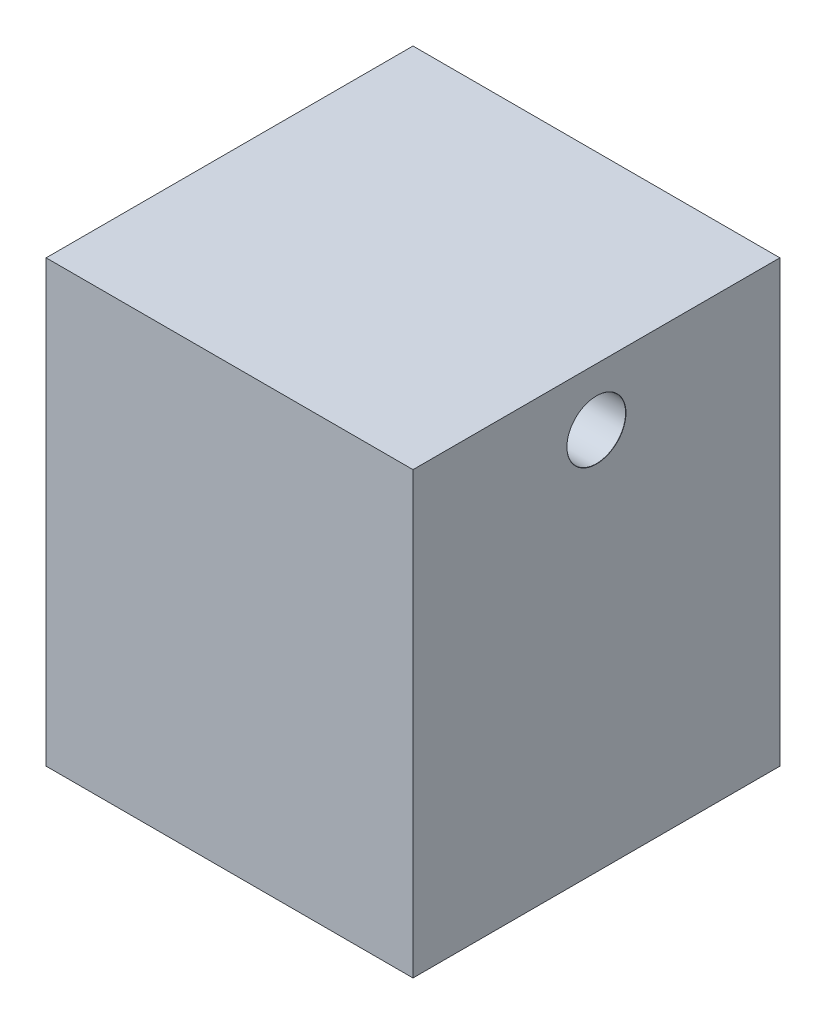
ISO-10303-21;
HEADER;
FILE_DESCRIPTION(('STEP AP214'),'2;1');
FILE_NAME('part.step','',(''),(''),'','','');
FILE_SCHEMA(('AUTOMOTIVE_DESIGN { 1 0 10303 214 1 1 1 1 }'));
ENDSEC;
DATA;
#1=APPLICATION_CONTEXT('core data for automotive mechanical design processes');
#2=APPLICATION_PROTOCOL_DEFINITION('international standard','automotive_design',2000,#1);
#3=PRODUCT_CONTEXT('',#1,'mechanical');
#4=PRODUCT('Part','Part','',(#3));
#5=PRODUCT_RELATED_PRODUCT_CATEGORY('part','',(#4));
#6=PRODUCT_DEFINITION_FORMATION('','',#4);
#7=PRODUCT_DEFINITION_CONTEXT('part definition',#1,'design');
#8=PRODUCT_DEFINITION('design','',#6,#7);
#9=PRODUCT_DEFINITION_SHAPE('','',#8);
#10=(LENGTH_UNIT() NAMED_UNIT(*) SI_UNIT(.MILLI.,.METRE.));
#11=(NAMED_UNIT(*) PLANE_ANGLE_UNIT() SI_UNIT($,.RADIAN.));
#12=(NAMED_UNIT(*) SI_UNIT($,.STERADIAN.) SOLID_ANGLE_UNIT());
#13=UNCERTAINTY_MEASURE_WITH_UNIT(LENGTH_MEASURE(1.E-05),#10,'distance_accuracy_value','');
#14=(GEOMETRIC_REPRESENTATION_CONTEXT(3) GLOBAL_UNCERTAINTY_ASSIGNED_CONTEXT((#13)) GLOBAL_UNIT_ASSIGNED_CONTEXT((#10,
#11,#12)) REPRESENTATION_CONTEXT('',''));
#15=CARTESIAN_POINT('',(0.,0.,0.));
#16=DIRECTION('',(0.,0.,1.));
#17=DIRECTION('',(1.,0.,0.));
#18=AXIS2_PLACEMENT_3D('',#15,#16,#17);
#19=CARTESIAN_POINT('',(-25.,60.0000000000001,-25.));
#20=DIRECTION('',(0.,0.,-1.));
#21=DIRECTION('',(-1.,0.,0.));
#22=AXIS2_PLACEMENT_3D('',#19,#20,#21);
#23=PLANE('',#22);
#24=DIRECTION('',(1.,0.,0.));
#25=VECTOR('',#24,1.);
#26=CARTESIAN_POINT('',(-25.,0.,-25.));
#27=LINE('',#26,#25);
#28=CARTESIAN_POINT('',(-25.,0.,-25.));
#29=VERTEX_POINT('',#28);
#30=CARTESIAN_POINT('',(25.,0.,-25.));
#31=VERTEX_POINT('',#30);
#32=EDGE_CURVE('E100',#29,#31,#27,.T.);
#33=ORIENTED_EDGE('',*,*,#32,.F.);
#34=DIRECTION('',(0.,-1.,0.));
#35=VECTOR('',#34,1.);
#36=CARTESIAN_POINT('',(-25.,60.0000000000001,-25.));
#37=LINE('',#36,#35);
#38=CARTESIAN_POINT('',(-25.,60.0000000000001,-25.));
#39=VERTEX_POINT('',#38);
#40=EDGE_CURVE('E11',#39,#29,#37,.T.);
#41=ORIENTED_EDGE('',*,*,#40,.F.);
#42=DIRECTION('',(1.,0.,0.));
#43=VECTOR('',#42,1.);
#44=CARTESIAN_POINT('',(-25.,60.0000000000001,-25.));
#45=LINE('',#44,#43);
#46=CARTESIAN_POINT('',(25.,60.0000000000001,-25.));
#47=VERTEX_POINT('',#46);
#48=EDGE_CURVE('E93',#39,#47,#45,.T.);
#49=ORIENTED_EDGE('',*,*,#48,.T.);
#50=DIRECTION('',(0.,-1.,0.));
#51=VECTOR('',#50,1.);
#52=CARTESIAN_POINT('',(25.,60.0000000000001,-25.));
#53=LINE('',#52,#51);
#54=EDGE_CURVE('E38',#47,#31,#53,.T.);
#55=ORIENTED_EDGE('',*,*,#54,.T.);
#56=EDGE_LOOP('',(#33,#41,#49,#55));
#57=FACE_BOUND('',#56,.T.);
#58=ADVANCED_FACE('F35',(#57),#23,.T.);
#59=CARTESIAN_POINT('',(-25.,60.0000000000001,25.));
#60=DIRECTION('',(-1.,0.,0.));
#61=DIRECTION('',(0.,0.,1.));
#62=AXIS2_PLACEMENT_3D('',#59,#60,#61);
#63=PLANE('',#62);
#64=CARTESIAN_POINT('',(-25.,52.1840721348913,0.));
#65=DIRECTION('',(1.,0.,0.));
#66=DIRECTION('',(0.,0.,-1.));
#67=AXIS2_PLACEMENT_3D('',#64,#65,#66);
#68=CIRCLE('',#67,3.99999999999999);
#69=CARTESIAN_POINT('',(-25.,52.1840721348913,-3.99999999999999));
#70=VERTEX_POINT('',#69);
#71=EDGE_CURVE('E104',#70,#70,#68,.T.);
#72=ORIENTED_EDGE('',*,*,#71,.T.);
#73=EDGE_LOOP('',(#72));
#74=FACE_BOUND('',#73,.T.);
#75=DIRECTION('',(0.,0.,-1.));
#76=VECTOR('',#75,1.);
#77=CARTESIAN_POINT('',(-25.,0.,25.));
#78=LINE('',#77,#76);
#79=CARTESIAN_POINT('',(-25.,0.,25.));
#80=VERTEX_POINT('',#79);
#81=EDGE_CURVE('E95',#80,#29,#78,.T.);
#82=ORIENTED_EDGE('',*,*,#81,.F.);
#83=DIRECTION('',(0.,-1.,0.));
#84=VECTOR('',#83,1.);
#85=CARTESIAN_POINT('',(-25.,60.0000000000001,25.));
#86=LINE('',#85,#84);
#87=CARTESIAN_POINT('',(-25.,60.0000000000001,25.));
#88=VERTEX_POINT('',#87);
#89=EDGE_CURVE('E44',#88,#80,#86,.T.);
#90=ORIENTED_EDGE('',*,*,#89,.F.);
#91=DIRECTION('',(0.,0.,-1.));
#92=VECTOR('',#91,1.);
#93=CARTESIAN_POINT('',(-25.,60.0000000000001,25.));
#94=LINE('',#93,#92);
#95=EDGE_CURVE('E83',#88,#39,#94,.T.);
#96=ORIENTED_EDGE('',*,*,#95,.T.);
#97=ORIENTED_EDGE('',*,*,#40,.T.);
#98=EDGE_LOOP('',(#82,#90,#96,#97));
#99=FACE_BOUND('',#98,.T.);
#100=ADVANCED_FACE('F111',(#74,#99),#63,.T.);
#101=CARTESIAN_POINT('',(-25.,60.0000000000001,25.));
#102=DIRECTION('',(0.,0.,-1.));
#103=DIRECTION('',(-1.,0.,0.));
#104=AXIS2_PLACEMENT_3D('',#101,#102,#103);
#105=PLANE('',#104);
#106=DIRECTION('',(1.,0.,0.));
#107=VECTOR('',#106,1.);
#108=CARTESIAN_POINT('',(-25.,0.,25.));
#109=LINE('',#108,#107);
#110=CARTESIAN_POINT('',(25.,0.,25.));
#111=VERTEX_POINT('',#110);
#112=EDGE_CURVE('E88',#80,#111,#109,.T.);
#113=ORIENTED_EDGE('',*,*,#112,.T.);
#114=DIRECTION('',(0.,-1.,0.));
#115=VECTOR('',#114,1.);
#116=CARTESIAN_POINT('',(25.,60.0000000000001,25.));
#117=LINE('',#116,#115);
#118=CARTESIAN_POINT('',(25.,60.0000000000001,25.));
#119=VERTEX_POINT('',#118);
#120=EDGE_CURVE('E86',#119,#111,#117,.T.);
#121=ORIENTED_EDGE('',*,*,#120,.F.);
#122=DIRECTION('',(1.,0.,0.));
#123=VECTOR('',#122,1.);
#124=CARTESIAN_POINT('',(-25.,60.0000000000001,25.));
#125=LINE('',#124,#123);
#126=EDGE_CURVE('E80',#88,#119,#125,.T.);
#127=ORIENTED_EDGE('',*,*,#126,.F.);
#128=ORIENTED_EDGE('',*,*,#89,.T.);
#129=EDGE_LOOP('',(#113,#121,#127,#128));
#130=FACE_BOUND('',#129,.T.);
#131=ADVANCED_FACE('F87',(#130),#105,.F.);
#132=CARTESIAN_POINT('',(25.,60.0000000000001,25.));
#133=DIRECTION('',(-1.,0.,0.));
#134=DIRECTION('',(0.,0.,1.));
#135=AXIS2_PLACEMENT_3D('',#132,#133,#134);
#136=PLANE('',#135);
#137=CARTESIAN_POINT('',(25.,52.1840721348913,0.));
#138=DIRECTION('',(1.,0.,0.));
#139=DIRECTION('',(0.,0.,-1.));
#140=AXIS2_PLACEMENT_3D('',#137,#138,#139);
#141=CIRCLE('',#140,4.025);
#142=CARTESIAN_POINT('',(25.,52.1840721348913,-4.025));
#143=VERTEX_POINT('',#142);
#144=EDGE_CURVE('E130',#143,#143,#141,.T.);
#145=ORIENTED_EDGE('',*,*,#144,.F.);
#146=EDGE_LOOP('',(#145));
#147=FACE_BOUND('',#146,.T.);
#148=DIRECTION('',(0.,0.,-1.));
#149=VECTOR('',#148,1.);
#150=CARTESIAN_POINT('',(25.,0.,25.));
#151=LINE('',#150,#149);
#152=EDGE_CURVE('E103',#111,#31,#151,.T.);
#153=ORIENTED_EDGE('',*,*,#152,.T.);
#154=ORIENTED_EDGE('',*,*,#54,.F.);
#155=DIRECTION('',(0.,0.,-1.));
#156=VECTOR('',#155,1.);
#157=CARTESIAN_POINT('',(25.,60.0000000000001,25.));
#158=LINE('',#157,#156);
#159=EDGE_CURVE('E77',#119,#47,#158,.T.);
#160=ORIENTED_EDGE('',*,*,#159,.F.);
#161=ORIENTED_EDGE('',*,*,#120,.T.);
#162=EDGE_LOOP('',(#153,#154,#160,#161));
#163=FACE_BOUND('',#162,.T.);
#164=ADVANCED_FACE('F92',(#147,#163),#136,.F.);
#165=CARTESIAN_POINT('',(0.,60.0000000000001,0.));
#166=DIRECTION('',(0.,1.,0.));
#167=DIRECTION('',(0.,0.,1.));
#168=AXIS2_PLACEMENT_3D('',#165,#166,#167);
#169=PLANE('',#168);
#170=ORIENTED_EDGE('',*,*,#48,.F.);
#171=ORIENTED_EDGE('',*,*,#95,.F.);
#172=ORIENTED_EDGE('',*,*,#126,.T.);
#173=ORIENTED_EDGE('',*,*,#159,.T.);
#174=EDGE_LOOP('',(#170,#171,#172,#173));
#175=FACE_BOUND('',#174,.T.);
#176=ADVANCED_FACE('F82',(#175),#169,.T.);
#177=CARTESIAN_POINT('',(0.,0.,0.));
#178=DIRECTION('',(0.,1.,0.));
#179=DIRECTION('',(0.,0.,1.));
#180=AXIS2_PLACEMENT_3D('',#177,#178,#179);
#181=PLANE('',#180);
#182=ORIENTED_EDGE('',*,*,#32,.T.);
#183=ORIENTED_EDGE('',*,*,#152,.F.);
#184=ORIENTED_EDGE('',*,*,#112,.F.);
#185=ORIENTED_EDGE('',*,*,#81,.T.);
#186=EDGE_LOOP('',(#182,#183,#184,#185));
#187=FACE_BOUND('',#186,.T.);
#188=ADVANCED_FACE('F110',(#187),#181,.F.);
#189=CARTESIAN_POINT('',(25.,52.1840721348913,0.));
#190=DIRECTION('',(1.,0.,0.));
#191=DIRECTION('',(0.,0.,-1.));
#192=AXIS2_PLACEMENT_3D('',#189,#190,#191);
#193=CYLINDRICAL_SURFACE('',#192,3.99999999999999);
#194=ORIENTED_EDGE('',*,*,#71,.F.);
#195=EDGE_LOOP('',(#194));
#196=FACE_BOUND('',#195,.T.);
#197=CARTESIAN_POINT('',(24.975,52.1840721348913,0.));
#198=DIRECTION('',(1.,0.,0.));
#199=DIRECTION('',(0.,0.,-1.));
#200=AXIS2_PLACEMENT_3D('',#197,#198,#199);
#201=CIRCLE('',#200,4.);
#202=CARTESIAN_POINT('',(24.975,52.1840721348913,-4.));
#203=VERTEX_POINT('',#202);
#204=EDGE_CURVE('E132',#203,#203,#201,.T.);
#205=ORIENTED_EDGE('',*,*,#204,.T.);
#206=EDGE_LOOP('',(#205));
#207=FACE_BOUND('',#206,.T.);
#208=ADVANCED_FACE('F138',(#196,#207),#193,.F.);
#209=CARTESIAN_POINT('',(25.,52.1840721348913,0.));
#210=DIRECTION('',(1.,0.,0.));
#211=DIRECTION('',(0.,0.,-1.));
#212=AXIS2_PLACEMENT_3D('',#209,#210,#211);
#213=CONICAL_SURFACE('',#212,4.025,0.785398163397448);
#214=ORIENTED_EDGE('',*,*,#204,.F.);
#215=EDGE_LOOP('',(#214));
#216=FACE_BOUND('',#215,.T.);
#217=ORIENTED_EDGE('',*,*,#144,.T.);
#218=EDGE_LOOP('',(#217));
#219=FACE_BOUND('',#218,.T.);
#220=ADVANCED_FACE('F141',(#216,#219),#213,.F.);
#221=CLOSED_SHELL('',(#58,#100,#131,#164,#176,#188,#208,#220));
#222=MANIFOLD_SOLID_BREP('B2',#221);
#223=ADVANCED_BREP_SHAPE_REPRESENTATION('',(#18,#222),#14);
#224=SHAPE_DEFINITION_REPRESENTATION(#9,#223);
ENDSEC;
END-ISO-10303-21;
